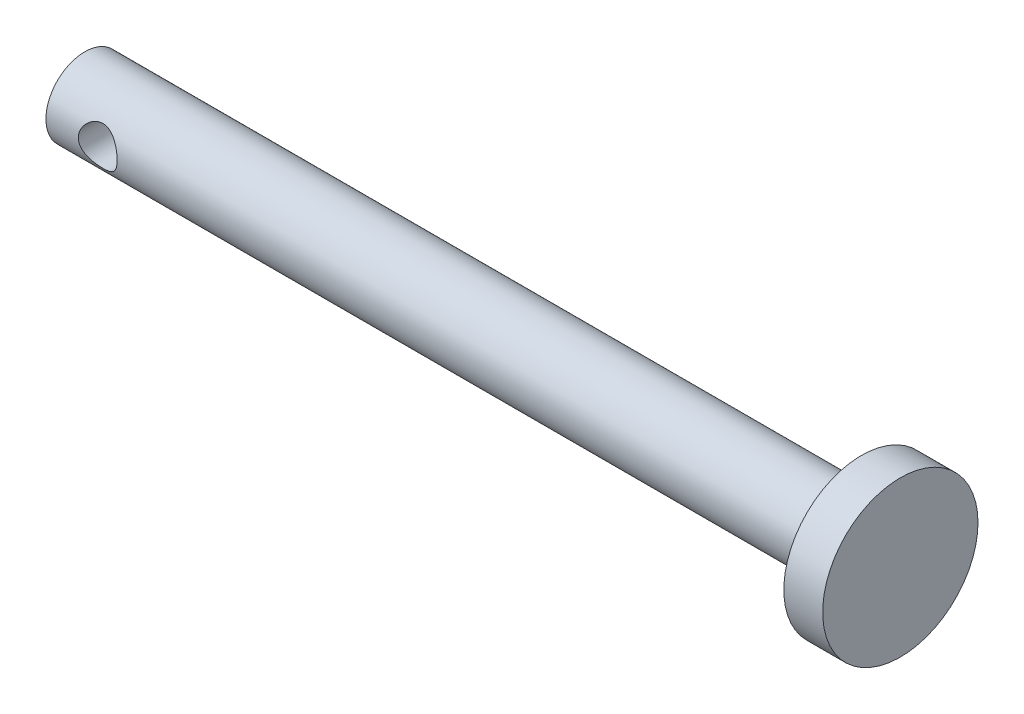
ISO-10303-21;
HEADER;
FILE_DESCRIPTION(('STEP AP214'),'2;1');
FILE_NAME('part.step','',(''),(''),'','','');
FILE_SCHEMA(('AUTOMOTIVE_DESIGN { 1 0 10303 214 1 1 1 1 }'));
ENDSEC;
DATA;
#1=APPLICATION_CONTEXT('core data for automotive mechanical design processes');
#2=APPLICATION_PROTOCOL_DEFINITION('international standard','automotive_design',2000,#1);
#3=PRODUCT_CONTEXT('',#1,'mechanical');
#4=PRODUCT('Part','Part','',(#3));
#5=PRODUCT_RELATED_PRODUCT_CATEGORY('part','',(#4));
#6=PRODUCT_DEFINITION_FORMATION('','',#4);
#7=PRODUCT_DEFINITION_CONTEXT('part definition',#1,'design');
#8=PRODUCT_DEFINITION('design','',#6,#7);
#9=PRODUCT_DEFINITION_SHAPE('','',#8);
#10=(LENGTH_UNIT() NAMED_UNIT(*) SI_UNIT(.MILLI.,.METRE.));
#11=(NAMED_UNIT(*) PLANE_ANGLE_UNIT() SI_UNIT($,.RADIAN.));
#12=(NAMED_UNIT(*) SI_UNIT($,.STERADIAN.) SOLID_ANGLE_UNIT());
#13=UNCERTAINTY_MEASURE_WITH_UNIT(LENGTH_MEASURE(1.E-05),#10,'distance_accuracy_value','');
#14=(GEOMETRIC_REPRESENTATION_CONTEXT(3) GLOBAL_UNCERTAINTY_ASSIGNED_CONTEXT((#13)) GLOBAL_UNIT_ASSIGNED_CONTEXT((#10,
#11,#12)) REPRESENTATION_CONTEXT('',''));
#15=CARTESIAN_POINT('',(0.,0.,0.));
#16=DIRECTION('',(0.,0.,1.));
#17=DIRECTION('',(1.,0.,0.));
#18=AXIS2_PLACEMENT_3D('',#15,#16,#17);
#19=CARTESIAN_POINT('',(60.,0.,0.));
#20=DIRECTION('',(-1.,0.,0.));
#21=DIRECTION('',(0.,0.,1.));
#22=AXIS2_PLACEMENT_3D('',#19,#20,#21);
#23=CYLINDRICAL_SURFACE('',#22,3.);
#24=CARTESIAN_POINT('',(5.49999999999999,0.,3.));
#25=CARTESIAN_POINT('',(5.4999950465242,-0.0788579444268508,2.99999570107562));
#26=CARTESIAN_POINT('',(5.49374489031841,-0.157809899546345,2.99685736529635));
#27=CARTESIAN_POINT('',(5.4690206794877,-0.313380352903345,2.98461234055736));
#28=CARTESIAN_POINT('',(5.45052341050328,-0.389994130070445,2.97549431743379));
#29=CARTESIAN_POINT('',(5.40220928707505,-0.538400317320673,2.95224419105063));
#30=CARTESIAN_POINT('',(5.37243642362805,-0.610210204408719,2.93813158766306));
#31=CARTESIAN_POINT('',(5.30264406795252,-0.747708925209897,2.90618664773642));
#32=CARTESIAN_POINT('',(5.2626253836267,-0.813398240985088,2.88835460450288));
#33=CARTESIAN_POINT('',(5.17072412577207,-0.941261726642864,2.84934387387093));
#34=CARTESIAN_POINT('',(5.11827028114054,-1.00298281668316,2.82802798691306));
#35=CARTESIAN_POINT('',(5.00421778112944,-1.11716916730047,2.78489955370115));
#36=CARTESIAN_POINT('',(4.94261222234134,-1.16962737466015,2.76308664313552));
#37=CARTESIAN_POINT('',(4.80627497571493,-1.26787800067542,2.71948426796021));
#38=CARTESIAN_POINT('',(4.73089585248113,-1.31283800332746,2.69782780455198));
#39=CARTESIAN_POINT('',(4.57244899602068,-1.38925234033604,2.65928968158481));
#40=CARTESIAN_POINT('',(4.48938680691588,-1.4207163224495,2.64240461410484));
#41=CARTESIAN_POINT('',(4.32300234186712,-1.46719866328288,2.61686800556713));
#42=CARTESIAN_POINT('',(4.23999332189891,-1.48308878562066,2.6077840737557));
#43=CARTESIAN_POINT('',(4.07203174333078,-1.50064048996327,2.59772834922792));
#44=CARTESIAN_POINT('',(3.98708118869327,-1.50231613255961,2.59674854014932));
#45=CARTESIAN_POINT('',(3.82857096352695,-1.49203093075844,2.60266395385873));
#46=CARTESIAN_POINT('',(3.75486395316542,-1.48167683930523,2.6086314549302));
#47=CARTESIAN_POINT('',(3.61041713594044,-1.4504097735854,2.62614343100776));
#48=CARTESIAN_POINT('',(3.53967828204203,-1.42949343584648,2.63768968247664));
#49=CARTESIAN_POINT('',(3.40115630115151,-1.37731467057901,2.66531214619112));
#50=CARTESIAN_POINT('',(3.33348040182132,-1.34582260067399,2.68148760995998));
#51=CARTESIAN_POINT('',(3.20404856111499,-1.273562531502,2.71655106422106));
#52=CARTESIAN_POINT('',(3.14229529659987,-1.2327903657187,2.73544027170286));
#53=CARTESIAN_POINT('',(3.01821812088516,-1.13709908236918,2.77669736854929));
#54=CARTESIAN_POINT('',(2.95681468963577,-1.08104168755392,2.79920265355119));
#55=CARTESIAN_POINT('',(2.84389687211365,-0.959333368112061,2.84321434950611));
#56=CARTESIAN_POINT('',(2.79238721194918,-0.893677884861429,2.86472027938201));
#57=CARTESIAN_POINT('',(2.69847150845541,-0.750774758747774,2.90552980924446));
#58=CARTESIAN_POINT('',(2.65659929133139,-0.673130387399115,2.92468476243011));
#59=CARTESIAN_POINT('',(2.58685445643549,-0.510699323233196,2.95736821681863));
#60=CARTESIAN_POINT('',(2.55897072247725,-0.425918364397915,2.9709011841533));
#61=CARTESIAN_POINT('',(2.52028689442499,-0.259149737491054,2.98986500612153));
#62=CARTESIAN_POINT('',(2.50826314637983,-0.17751229582249,2.99587407451965));
#63=CARTESIAN_POINT('',(2.49780290329827,-0.0131693999240284,3.00109520188655));
#64=CARTESIAN_POINT('',(2.4993599715408,0.0695355298048622,3.00031048081978));
#65=CARTESIAN_POINT('',(2.51531003262812,0.22684945797898,2.99236788380152));
#66=CARTESIAN_POINT('',(2.52869879909499,0.301589112074894,2.98570868532253));
#67=CARTESIAN_POINT('',(2.56635710784268,0.447610338452911,2.9673325697226));
#68=CARTESIAN_POINT('',(2.59062784968024,0.51889152853663,2.95561509501618));
#69=CARTESIAN_POINT('',(2.64999769964955,0.658332912674359,2.92776377120382));
#70=CARTESIAN_POINT('',(2.68538657517443,0.726345595508704,2.91151322654446));
#71=CARTESIAN_POINT('',(2.76566130346985,0.855692042548907,2.87615961476126));
#72=CARTESIAN_POINT('',(2.81055120189309,0.917022944664887,2.85705533350407));
#73=CARTESIAN_POINT('',(2.91364063799608,1.03765153393382,2.81562332004297));
#74=CARTESIAN_POINT('',(2.97271430266772,1.09615811672854,2.79316327265249));
#75=CARTESIAN_POINT('',(3.09988772691659,1.20278448167828,2.7489358741323));
#76=CARTESIAN_POINT('',(3.16799367827188,1.25089707856781,2.72716901100071));
#77=CARTESIAN_POINT('',(3.31546548125946,1.33756187171853,2.68576788309734));
#78=CARTESIAN_POINT('',(3.39521689914172,1.37553824370037,2.66628794383591));
#79=CARTESIAN_POINT('',(3.56126510136245,1.43712423890206,2.63361108441202));
#80=CARTESIAN_POINT('',(3.64755328970034,1.46075237380052,2.62040607332625));
#81=CARTESIAN_POINT('',(3.81536533432706,1.49079253120031,2.60342251538703));
#82=CARTESIAN_POINT('',(3.89655138015286,1.49863949460818,2.59886075197597));
#83=CARTESIAN_POINT('',(4.05917060074679,1.5010337315643,2.59748031962405));
#84=CARTESIAN_POINT('',(4.14060365310679,1.49558676993486,2.60065829439585));
#85=CARTESIAN_POINT('',(4.29322525230016,1.47288918838996,2.61356793076615));
#86=CARTESIAN_POINT('',(4.36465070521711,1.45681247151455,2.62264641723988));
#87=CARTESIAN_POINT('',(4.50371217913655,1.41476303733662,2.64556524281479));
#88=CARTESIAN_POINT('',(4.57134697313805,1.38878713673988,2.65940711354503));
#89=CARTESIAN_POINT('',(4.7059372764798,1.32572361795085,2.69142795546804));
#90=CARTESIAN_POINT('',(4.77254185274354,1.28800670672355,2.70983583593881));
#91=CARTESIAN_POINT('',(4.89891180427189,1.20322645745609,2.74852997452291));
#92=CARTESIAN_POINT('',(4.95867359578167,1.15615825686234,2.76881720693416));
#93=CARTESIAN_POINT('',(5.07721297353201,1.04730498999206,2.81193484737138));
#94=CARTESIAN_POINT('',(5.13498865352544,0.984426634495892,2.83477474959942));
#95=CARTESIAN_POINT('',(5.2393944751529,0.849232209349796,2.87816628389896));
#96=CARTESIAN_POINT('',(5.28601860920486,0.776911084957797,2.89871667939293));
#97=CARTESIAN_POINT('',(5.3668545440681,0.62389739517442,2.93547014349806));
#98=CARTESIAN_POINT('',(5.4009762538547,0.543149255665097,2.95164144740899));
#99=CARTESIAN_POINT('',(5.45471225163611,0.376113151707131,2.9775201194848));
#100=CARTESIAN_POINT('',(5.47436777020857,0.289841699383651,2.98724585044602));
#101=CARTESIAN_POINT('',(5.49084611662861,0.168902919736344,2.99543192870217));
#102=CARTESIAN_POINT('',(5.49427396129951,0.135242819162348,2.99714048010376));
#103=CARTESIAN_POINT('',(5.49885199827112,0.0677275977076376,2.99942545465223));
#104=CARTESIAN_POINT('',(5.5000021277053,0.0338724714699428,3.00000184655071));
#105=CARTESIAN_POINT('',(5.49999999999999,0.,3.));
#106=B_SPLINE_CURVE_WITH_KNOTS('',3,(#24,#25,#26,#27,#28,#29,#30,#31,#32,#33,#34,#35,#36,#37,
#38,#39,#40,#41,#42,#43,#44,#45,#46,#47,#48,#49,#50,#51,#52,#53,#54,#55,#56,#57,#58,#59,#60,#61,
#62,#63,#64,#65,#66,#67,#68,#69,#70,#71,#72,#73,#74,#75,#76,#77,#78,#79,#80,#81,#82,#83,#84,#85,
#86,#87,#88,#89,#90,#91,#92,#93,#94,#95,#96,#97,#98,#99,#100,#101,#102,#103,#104,#105),
.UNSPECIFIED.,.T.,.F.,(4,2,2,2,2,2,2,2,2,2,2,2,2,2,2,2,2,2,2,2,2,2,2,2,2,2,2,2,2,2,2,2,2,2,2,2,
2,2,2,2,4),(0.,0.23643638613044,0.473322224563796,0.709293233238446,0.94524564087235,
1.19547263807713,1.44588935648105,1.71572589646129,1.98536921847421,2.23887018210344,
2.4921203599353,2.71508568613981,2.93812205888517,3.16635360252731,3.39468781890332,
3.65197412000817,3.90938301898029,4.17874533321661,4.44789325368419,4.69474935707018,
4.94148846767214,5.16910359759183,5.39674382446397,5.63089284041848,5.86514176122509,
6.12239415966628,6.37982382923147,6.64972023242588,6.91926767918176,7.1629396125457,
7.40650589797017,7.62686895373283,7.84730293182526,8.0825468517043,8.31791341715446,
8.58187864135757,8.84598575071868,9.1119602049529,9.37717362931724,9.47872920200875,
9.58028757766599),.UNSPECIFIED.);
#107=CARTESIAN_POINT('',(5.49999999999999,0.,3.));
#108=VERTEX_POINT('',#107);
#109=EDGE_CURVE('E45',#108,#108,#106,.T.);
#110=ORIENTED_EDGE('',*,*,#109,.T.);
#111=EDGE_LOOP('',(#110));
#112=FACE_BOUND('',#111,.T.);
#113=CARTESIAN_POINT('',(5.5,0.,-3.));
#114=CARTESIAN_POINT('',(5.49999504652421,0.0788579444268501,-2.99999570107562));
#115=CARTESIAN_POINT('',(5.49374489031842,0.157809899546343,-2.99685736529635));
#116=CARTESIAN_POINT('',(5.46902067948769,0.313380352903344,-2.98461234055736));
#117=CARTESIAN_POINT('',(5.45052341050328,0.389994130070444,-2.97549431743379));
#118=CARTESIAN_POINT('',(5.40220928707506,0.538400317320673,-2.95224419105063));
#119=CARTESIAN_POINT('',(5.37243642362805,0.610210204408719,-2.93813158766306));
#120=CARTESIAN_POINT('',(5.30264406795252,0.747708925209897,-2.90618664773642));
#121=CARTESIAN_POINT('',(5.2626253836267,0.813398240985088,-2.88835460450288));
#122=CARTESIAN_POINT('',(5.17072412577207,0.941261726642863,-2.84934387387093));
#123=CARTESIAN_POINT('',(5.11827028114054,1.00298281668316,-2.82802798691306));
#124=CARTESIAN_POINT('',(5.00421778112945,1.11716916730047,-2.78489955370115));
#125=CARTESIAN_POINT('',(4.94261222234134,1.16962737466015,-2.76308664313552));
#126=CARTESIAN_POINT('',(4.80627497571493,1.26787800067542,-2.71948426796021));
#127=CARTESIAN_POINT('',(4.73089585248113,1.31283800332745,-2.69782780455198));
#128=CARTESIAN_POINT('',(4.57244899602068,1.38925234033604,-2.65928968158481));
#129=CARTESIAN_POINT('',(4.48938680691588,1.4207163224495,-2.64240461410484));
#130=CARTESIAN_POINT('',(4.32300234186712,1.46719866328288,-2.61686800556713));
#131=CARTESIAN_POINT('',(4.23999332189891,1.48308878562066,-2.6077840737557));
#132=CARTESIAN_POINT('',(4.07203174333079,1.50064048996327,-2.59772834922792));
#133=CARTESIAN_POINT('',(3.98708118869327,1.50231613255961,-2.59674854014932));
#134=CARTESIAN_POINT('',(3.82857096352695,1.49203093075844,-2.60266395385873));
#135=CARTESIAN_POINT('',(3.75486395316543,1.48167683930523,-2.6086314549302));
#136=CARTESIAN_POINT('',(3.61041713594044,1.4504097735854,-2.62614343100775));
#137=CARTESIAN_POINT('',(3.53967828204203,1.42949343584648,-2.63768968247664));
#138=CARTESIAN_POINT('',(3.40115630115151,1.37731467057901,-2.66531214619112));
#139=CARTESIAN_POINT('',(3.33348040182132,1.34582260067399,-2.68148760995998));
#140=CARTESIAN_POINT('',(3.20404856111499,1.273562531502,-2.71655106422106));
#141=CARTESIAN_POINT('',(3.14229529659987,1.2327903657187,-2.73544027170286));
#142=CARTESIAN_POINT('',(3.01821812088516,1.13709908236918,-2.77669736854929));
#143=CARTESIAN_POINT('',(2.95681468963577,1.08104168755392,-2.79920265355119));
#144=CARTESIAN_POINT('',(2.84389687211365,0.95933336811206,-2.84321434950611));
#145=CARTESIAN_POINT('',(2.79238721194918,0.893677884861428,-2.86472027938201));
#146=CARTESIAN_POINT('',(2.69847150845541,0.750774758747773,-2.90552980924446));
#147=CARTESIAN_POINT('',(2.65659929133139,0.673130387399114,-2.92468476243011));
#148=CARTESIAN_POINT('',(2.58685445643549,0.510699323233196,-2.95736821681863));
#149=CARTESIAN_POINT('',(2.55897072247725,0.425918364397914,-2.9709011841533));
#150=CARTESIAN_POINT('',(2.52028689442499,0.259149737491054,-2.98986500612153));
#151=CARTESIAN_POINT('',(2.50826314637983,0.17751229582249,-2.99587407451965));
#152=CARTESIAN_POINT('',(2.49780290329827,0.0131693999240283,-3.00109520188655));
#153=CARTESIAN_POINT('',(2.4993599715408,-0.0695355298048622,-3.00031048081978));
#154=CARTESIAN_POINT('',(2.51531003262812,-0.226849457978979,-2.99236788380152));
#155=CARTESIAN_POINT('',(2.52869879909499,-0.301589112074894,-2.98570868532253));
#156=CARTESIAN_POINT('',(2.56635710784268,-0.44761033845291,-2.9673325697226));
#157=CARTESIAN_POINT('',(2.59062784968024,-0.518891528536629,-2.95561509501618));
#158=CARTESIAN_POINT('',(2.64999769964955,-0.658332912674358,-2.92776377120382));
#159=CARTESIAN_POINT('',(2.68538657517443,-0.726345595508704,-2.91151322654446));
#160=CARTESIAN_POINT('',(2.76566130346985,-0.855692042548906,-2.87615961476127));
#161=CARTESIAN_POINT('',(2.81055120189309,-0.917022944664886,-2.85705533350408));
#162=CARTESIAN_POINT('',(2.91364063799607,-1.03765153393382,-2.81562332004297));
#163=CARTESIAN_POINT('',(2.97271430266772,-1.09615811672854,-2.79316327265249));
#164=CARTESIAN_POINT('',(3.09988772691659,-1.20278448167828,-2.7489358741323));
#165=CARTESIAN_POINT('',(3.16799367827188,-1.25089707856781,-2.72716901100071));
#166=CARTESIAN_POINT('',(3.31546548125946,-1.33756187171853,-2.68576788309734));
#167=CARTESIAN_POINT('',(3.39521689914172,-1.37553824370037,-2.66628794383591));
#168=CARTESIAN_POINT('',(3.56126510136245,-1.43712423890205,-2.63361108441202));
#169=CARTESIAN_POINT('',(3.64755328970033,-1.46075237380052,-2.62040607332625));
#170=CARTESIAN_POINT('',(3.81536533432706,-1.49079253120031,-2.60342251538703));
#171=CARTESIAN_POINT('',(3.89655138015286,-1.49863949460818,-2.59886075197597));
#172=CARTESIAN_POINT('',(4.05917060074679,-1.5010337315643,-2.59748031962405));
#173=CARTESIAN_POINT('',(4.14060365310679,-1.49558676993486,-2.60065829439585));
#174=CARTESIAN_POINT('',(4.29322525230016,-1.47288918838996,-2.61356793076615));
#175=CARTESIAN_POINT('',(4.36465070521711,-1.45681247151455,-2.62264641723988));
#176=CARTESIAN_POINT('',(4.50371217913655,-1.41476303733662,-2.64556524281479));
#177=CARTESIAN_POINT('',(4.57134697313805,-1.38878713673988,-2.65940711354503));
#178=CARTESIAN_POINT('',(4.7059372764798,-1.32572361795085,-2.69142795546804));
#179=CARTESIAN_POINT('',(4.77254185274354,-1.28800670672355,-2.70983583593881));
#180=CARTESIAN_POINT('',(4.89891180427189,-1.20322645745609,-2.74852997452291));
#181=CARTESIAN_POINT('',(4.95867359578167,-1.15615825686234,-2.76881720693416));
#182=CARTESIAN_POINT('',(5.07721297353201,-1.04730498999206,-2.81193484737138));
#183=CARTESIAN_POINT('',(5.13498865352544,-0.984426634495892,-2.83477474959942));
#184=CARTESIAN_POINT('',(5.2393944751529,-0.849232209349796,-2.87816628389896));
#185=CARTESIAN_POINT('',(5.28601860920486,-0.776911084957796,-2.89871667939293));
#186=CARTESIAN_POINT('',(5.3668545440681,-0.623897395174419,-2.93547014349806));
#187=CARTESIAN_POINT('',(5.4009762538547,-0.543149255665096,-2.95164144740899));
#188=CARTESIAN_POINT('',(5.45471225163611,-0.376113151707131,-2.9775201194848));
#189=CARTESIAN_POINT('',(5.47436777020857,-0.289841699383651,-2.98724585044602));
#190=CARTESIAN_POINT('',(5.49084611662861,-0.168902919736344,-2.99543192870217));
#191=CARTESIAN_POINT('',(5.49427396129951,-0.135242819162348,-2.99714048010376));
#192=CARTESIAN_POINT('',(5.49885199827113,-0.0677275977076382,-2.99942545465223));
#193=CARTESIAN_POINT('',(5.50000212770531,-0.0338724714699431,-3.00000184655071));
#194=CARTESIAN_POINT('',(5.5,0.,-3.));
#195=B_SPLINE_CURVE_WITH_KNOTS('',3,(#113,#114,#115,#116,#117,#118,#119,#120,#121,#122,#123,
#124,#125,#126,#127,#128,#129,#130,#131,#132,#133,#134,#135,#136,#137,#138,#139,#140,#141,#142,
#143,#144,#145,#146,#147,#148,#149,#150,#151,#152,#153,#154,#155,#156,#157,#158,#159,#160,#161,
#162,#163,#164,#165,#166,#167,#168,#169,#170,#171,#172,#173,#174,#175,#176,#177,#178,#179,#180,
#181,#182,#183,#184,#185,#186,#187,#188,#189,#190,#191,#192,#193,#194),.UNSPECIFIED.,.T.,.F.,(4,
2,2,2,2,2,2,2,2,2,2,2,2,2,2,2,2,2,2,2,2,2,2,2,2,2,2,2,2,2,2,2,2,2,2,2,2,2,2,2,4),(0.,
0.236436386130438,0.473322224563796,0.709293233238447,0.945245640872351,1.19547263807713,
1.44588935648105,1.71572589646129,1.98536921847421,2.23887018210344,2.4921203599353,
2.71508568613981,2.93812205888517,3.16635360252731,3.39468781890332,3.65197412000817,
3.90938301898029,4.17874533321661,4.44789325368419,4.69474935707018,4.94148846767214,
5.16910359759182,5.39674382446397,5.63089284041847,5.86514176122508,6.12239415966628,
6.37982382923147,6.64972023242588,6.91926767918176,7.16293961254569,7.40650589797017,
7.62686895373283,7.84730293182526,8.0825468517043,8.31791341715446,8.58187864135757,
8.84598575071868,9.11196020495289,9.37717362931723,9.47872920200875,9.58028757766599),.UNSPECIFIED.);
#196=CARTESIAN_POINT('',(5.5,0.,-3.));
#197=VERTEX_POINT('',#196);
#198=EDGE_CURVE('E63',#197,#197,#195,.T.);
#199=ORIENTED_EDGE('',*,*,#198,.T.);
#200=EDGE_LOOP('',(#199));
#201=FACE_BOUND('',#200,.T.);
#202=CARTESIAN_POINT('',(60.,0.,0.));
#203=DIRECTION('',(1.,0.,0.));
#204=DIRECTION('',(0.,0.,-1.));
#205=AXIS2_PLACEMENT_3D('',#202,#203,#204);
#206=CIRCLE('',#205,3.);
#207=CARTESIAN_POINT('',(60.,0.,-3.));
#208=VERTEX_POINT('',#207);
#209=EDGE_CURVE('E10',#208,#208,#206,.T.);
#210=ORIENTED_EDGE('',*,*,#209,.F.);
#211=EDGE_LOOP('',(#210));
#212=FACE_BOUND('',#211,.T.);
#213=CARTESIAN_POINT('',(0.,0.,0.));
#214=DIRECTION('',(1.,0.,0.));
#215=DIRECTION('',(0.,0.,-1.));
#216=AXIS2_PLACEMENT_3D('',#213,#214,#215);
#217=CIRCLE('',#216,3.);
#218=CARTESIAN_POINT('',(0.,0.,-3.));
#219=VERTEX_POINT('',#218);
#220=EDGE_CURVE('E53',#219,#219,#217,.T.);
#221=ORIENTED_EDGE('',*,*,#220,.T.);
#222=EDGE_LOOP('',(#221));
#223=FACE_BOUND('',#222,.T.);
#224=ADVANCED_FACE('F41',(#112,#201,#212,#223),#23,.T.);
#225=CARTESIAN_POINT('',(0.,0.,0.));
#226=DIRECTION('',(1.,0.,0.));
#227=DIRECTION('',(0.,0.,-1.));
#228=AXIS2_PLACEMENT_3D('',#225,#226,#227);
#229=PLANE('',#228);
#230=ORIENTED_EDGE('',*,*,#220,.F.);
#231=EDGE_LOOP('',(#230));
#232=FACE_BOUND('',#231,.T.);
#233=ADVANCED_FACE('F83',(#232),#229,.F.);
#234=CARTESIAN_POINT('',(63.,0.,0.));
#235=DIRECTION('',(-1.,0.,0.));
#236=DIRECTION('',(0.,0.,1.));
#237=AXIS2_PLACEMENT_3D('',#234,#235,#236);
#238=CYLINDRICAL_SURFACE('',#237,6.);
#239=CARTESIAN_POINT('',(63.,0.,0.));
#240=DIRECTION('',(1.,0.,0.));
#241=DIRECTION('',(0.,0.,-1.));
#242=AXIS2_PLACEMENT_3D('',#239,#240,#241);
#243=CIRCLE('',#242,6.);
#244=CARTESIAN_POINT('',(63.,0.,-6.));
#245=VERTEX_POINT('',#244);
#246=EDGE_CURVE('E58',#245,#245,#243,.T.);
#247=ORIENTED_EDGE('',*,*,#246,.F.);
#248=EDGE_LOOP('',(#247));
#249=FACE_BOUND('',#248,.T.);
#250=CARTESIAN_POINT('',(60.,0.,0.));
#251=DIRECTION('',(1.,0.,0.));
#252=DIRECTION('',(0.,0.,-1.));
#253=AXIS2_PLACEMENT_3D('',#250,#251,#252);
#254=CIRCLE('',#253,6.);
#255=CARTESIAN_POINT('',(60.,0.,-6.));
#256=VERTEX_POINT('',#255);
#257=EDGE_CURVE('E61',#256,#256,#254,.T.);
#258=ORIENTED_EDGE('',*,*,#257,.T.);
#259=EDGE_LOOP('',(#258));
#260=FACE_BOUND('',#259,.T.);
#261=ADVANCED_FACE('F78',(#249,#260),#238,.T.);
#262=CARTESIAN_POINT('',(63.,0.,0.));
#263=DIRECTION('',(1.,0.,0.));
#264=DIRECTION('',(0.,0.,-1.));
#265=AXIS2_PLACEMENT_3D('',#262,#263,#264);
#266=PLANE('',#265);
#267=ORIENTED_EDGE('',*,*,#246,.T.);
#268=EDGE_LOOP('',(#267));
#269=FACE_BOUND('',#268,.T.);
#270=ADVANCED_FACE('F74',(#269),#266,.T.);
#271=CARTESIAN_POINT('',(60.,0.,0.));
#272=DIRECTION('',(1.,0.,0.));
#273=DIRECTION('',(0.,0.,-1.));
#274=AXIS2_PLACEMENT_3D('',#271,#272,#273);
#275=PLANE('',#274);
#276=ORIENTED_EDGE('',*,*,#209,.T.);
#277=EDGE_LOOP('',(#276));
#278=FACE_BOUND('',#277,.T.);
#279=ORIENTED_EDGE('',*,*,#257,.F.);
#280=EDGE_LOOP('',(#279));
#281=FACE_BOUND('',#280,.T.);
#282=ADVANCED_FACE('F72',(#278,#281),#275,.F.);
#283=CARTESIAN_POINT('',(4.,0.,-6.));
#284=DIRECTION('',(0.,0.,1.));
#285=DIRECTION('',(1.,0.,0.));
#286=AXIS2_PLACEMENT_3D('',#283,#284,#285);
#287=CYLINDRICAL_SURFACE('',#286,1.5);
#288=ORIENTED_EDGE('',*,*,#198,.F.);
#289=EDGE_LOOP('',(#288));
#290=FACE_BOUND('',#289,.T.);
#291=ORIENTED_EDGE('',*,*,#109,.F.);
#292=EDGE_LOOP('',(#291));
#293=FACE_BOUND('',#292,.T.);
#294=ADVANCED_FACE('F68',(#290,#293),#287,.F.);
#295=CLOSED_SHELL('',(#224,#233,#261,#270,#282,#294));
#296=MANIFOLD_SOLID_BREP('B2',#295);
#297=ADVANCED_BREP_SHAPE_REPRESENTATION('',(#18,#296),#14);
#298=SHAPE_DEFINITION_REPRESENTATION(#9,#297);
ENDSEC;
END-ISO-10303-21;
